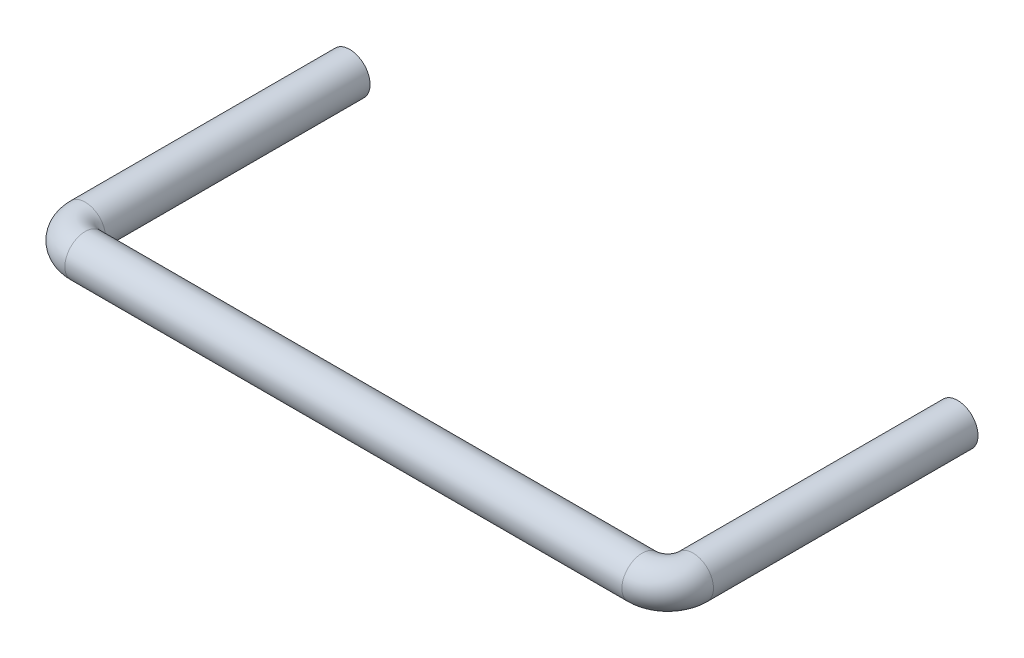
ISO-10303-21;
HEADER;
FILE_DESCRIPTION(('STEP AP214'),'2;1');
FILE_NAME('part.step','',(''),(''),'','','');
FILE_SCHEMA(('AUTOMOTIVE_DESIGN { 1 0 10303 214 1 1 1 1 }'));
ENDSEC;
DATA;
#1=APPLICATION_CONTEXT('core data for automotive mechanical design processes');
#2=APPLICATION_PROTOCOL_DEFINITION('international standard','automotive_design',2000,#1);
#3=PRODUCT_CONTEXT('',#1,'mechanical');
#4=PRODUCT('Part','Part','',(#3));
#5=PRODUCT_RELATED_PRODUCT_CATEGORY('part','',(#4));
#6=PRODUCT_DEFINITION_FORMATION('','',#4);
#7=PRODUCT_DEFINITION_CONTEXT('part definition',#1,'design');
#8=PRODUCT_DEFINITION('design','',#6,#7);
#9=PRODUCT_DEFINITION_SHAPE('','',#8);
#10=(LENGTH_UNIT() NAMED_UNIT(*) SI_UNIT(.MILLI.,.METRE.));
#11=(NAMED_UNIT(*) PLANE_ANGLE_UNIT() SI_UNIT($,.RADIAN.));
#12=(NAMED_UNIT(*) SI_UNIT($,.STERADIAN.) SOLID_ANGLE_UNIT());
#13=UNCERTAINTY_MEASURE_WITH_UNIT(LENGTH_MEASURE(1.E-05),#10,'distance_accuracy_value','');
#14=(GEOMETRIC_REPRESENTATION_CONTEXT(3) GLOBAL_UNCERTAINTY_ASSIGNED_CONTEXT((#13)) GLOBAL_UNIT_ASSIGNED_CONTEXT((#10,
#11,#12)) REPRESENTATION_CONTEXT('',''));
#15=CARTESIAN_POINT('',(0.,0.,0.));
#16=DIRECTION('',(0.,0.,1.));
#17=DIRECTION('',(1.,0.,0.));
#18=AXIS2_PLACEMENT_3D('',#15,#16,#17);
#19=CARTESIAN_POINT('',(11.95,0.,0.));
#20=DIRECTION('',(0.,0.,-1.));
#21=DIRECTION('',(-1.,0.,0.));
#22=AXIS2_PLACEMENT_3D('',#19,#20,#21);
#23=PLANE('',#22);
#24=CARTESIAN_POINT('',(11.95,0.,0.));
#25=DIRECTION('',(0.,0.,-1.));
#26=DIRECTION('',(-1.,0.,0.));
#27=AXIS2_PLACEMENT_3D('',#24,#25,#26);
#28=CIRCLE('',#27,0.8);
#29=CARTESIAN_POINT('',(11.15,0.,0.));
#30=VERTEX_POINT('',#29);
#31=EDGE_CURVE('E56',#30,#30,#28,.T.);
#32=ORIENTED_EDGE('',*,*,#31,.T.);
#33=EDGE_LOOP('',(#32));
#34=FACE_BOUND('',#33,.T.);
#35=ADVANCED_FACE('F44',(#34),#23,.T.);
#36=CARTESIAN_POINT('',(-11.95,0.,0.));
#37=DIRECTION('',(0.,0.,1.));
#38=DIRECTION('',(1.,0.,0.));
#39=AXIS2_PLACEMENT_3D('',#36,#37,#38);
#40=PLANE('',#39);
#41=CARTESIAN_POINT('',(-11.95,0.,0.));
#42=DIRECTION('',(0.,0.,1.));
#43=DIRECTION('',(1.,0.,0.));
#44=AXIS2_PLACEMENT_3D('',#41,#42,#43);
#45=CIRCLE('',#44,0.8);
#46=CARTESIAN_POINT('',(-11.15,0.,0.));
#47=VERTEX_POINT('',#46);
#48=EDGE_CURVE('E12',#47,#47,#45,.T.);
#49=ORIENTED_EDGE('',*,*,#48,.F.);
#50=EDGE_LOOP('',(#49));
#51=FACE_BOUND('',#50,.T.);
#52=ADVANCED_FACE('F62',(#51),#40,.F.);
#53=CARTESIAN_POINT('',(11.95,0.,0.));
#54=DIRECTION('',(0.,0.,1.));
#55=DIRECTION('',(1.,0.,0.));
#56=AXIS2_PLACEMENT_3D('',#53,#54,#55);
#57=CYLINDRICAL_SURFACE('',#56,0.8);
#58=CARTESIAN_POINT('',(11.95,0.,10.4));
#59=DIRECTION('',(0.,0.,-1.));
#60=DIRECTION('',(-1.,0.,0.));
#61=AXIS2_PLACEMENT_3D('',#58,#59,#60);
#62=CIRCLE('',#61,0.8);
#63=CARTESIAN_POINT('',(12.75,0.,10.4));
#64=VERTEX_POINT('',#63);
#65=EDGE_CURVE('E96',#64,#64,#62,.T.);
#66=ORIENTED_EDGE('',*,*,#65,.T.);
#67=EDGE_LOOP('',(#66));
#68=FACE_BOUND('',#67,.T.);
#69=ORIENTED_EDGE('',*,*,#31,.F.);
#70=EDGE_LOOP('',(#69));
#71=FACE_BOUND('',#70,.T.);
#72=ADVANCED_FACE('F64',(#68,#71),#57,.T.);
#73=CARTESIAN_POINT('',(10.95,0.,10.4));
#74=DIRECTION('',(0.,-1.,0.));
#75=DIRECTION('',(0.,0.,-1.));
#76=AXIS2_PLACEMENT_3D('',#73,#74,#75);
#77=TOROIDAL_SURFACE('',#76,1.,0.8);
#78=CARTESIAN_POINT('',(10.95,0.,11.4));
#79=DIRECTION('',(1.,0.,0.));
#80=DIRECTION('',(0.,0.,-1.));
#81=AXIS2_PLACEMENT_3D('',#78,#79,#80);
#82=CIRCLE('',#81,0.8);
#83=CARTESIAN_POINT('',(10.95,0.,12.2));
#84=VERTEX_POINT('',#83);
#85=EDGE_CURVE('E93',#84,#84,#82,.T.);
#86=CARTESIAN_POINT('',(10.95,0.,10.4));
#87=DIRECTION('',(0.,-1.,0.));
#88=DIRECTION('',(0.,0.,-1.));
#89=AXIS2_PLACEMENT_3D('',#86,#87,#88);
#90=CIRCLE('',#89,1.8);
#91=EDGE_CURVE('',#64,#84,#90,.T.);
#92=ORIENTED_EDGE('',*,*,#65,.F.);
#93=ORIENTED_EDGE('',*,*,#85,.T.);
#94=ORIENTED_EDGE('',*,*,#91,.T.);
#95=ORIENTED_EDGE('',*,*,#91,.F.);
#96=EDGE_LOOP('',(#92,#94,#93,#95));
#97=FACE_BOUND('',#96,.T.);
#98=ADVANCED_FACE('F69',(#97),#77,.T.);
#99=CARTESIAN_POINT('',(10.95,0.,11.4));
#100=DIRECTION('',(-1.,0.,0.));
#101=DIRECTION('',(0.,0.,1.));
#102=AXIS2_PLACEMENT_3D('',#99,#100,#101);
#103=CYLINDRICAL_SURFACE('',#102,0.8);
#104=CARTESIAN_POINT('',(-10.95,0.,11.4));
#105=DIRECTION('',(1.,0.,0.));
#106=DIRECTION('',(0.,0.,-1.));
#107=AXIS2_PLACEMENT_3D('',#104,#105,#106);
#108=CIRCLE('',#107,0.8);
#109=CARTESIAN_POINT('',(-10.95,0.,12.2));
#110=VERTEX_POINT('',#109);
#111=EDGE_CURVE('E98',#110,#110,#108,.T.);
#112=ORIENTED_EDGE('',*,*,#111,.T.);
#113=EDGE_LOOP('',(#112));
#114=FACE_BOUND('',#113,.T.);
#115=ORIENTED_EDGE('',*,*,#85,.F.);
#116=EDGE_LOOP('',(#115));
#117=FACE_BOUND('',#116,.T.);
#118=ADVANCED_FACE('F79',(#114,#117),#103,.T.);
#119=CARTESIAN_POINT('',(-10.95,0.,10.4));
#120=DIRECTION('',(0.,-1.,0.));
#121=DIRECTION('',(0.,0.,-1.));
#122=AXIS2_PLACEMENT_3D('',#119,#120,#121);
#123=TOROIDAL_SURFACE('',#122,0.999999999999999,0.8);
#124=CARTESIAN_POINT('',(-11.95,0.,10.4000000000001));
#125=DIRECTION('',(0.,0.,1.));
#126=DIRECTION('',(1.,0.,0.));
#127=AXIS2_PLACEMENT_3D('',#124,#125,#126);
#128=CIRCLE('',#127,0.8);
#129=CARTESIAN_POINT('',(-12.75,0.,10.4000000000002));
#130=VERTEX_POINT('',#129);
#131=EDGE_CURVE('E51',#130,#130,#128,.T.);
#132=CARTESIAN_POINT('',(-10.95,0.,10.4));
#133=DIRECTION('',(0.,-1.,0.));
#134=DIRECTION('',(0.,0.,-1.));
#135=AXIS2_PLACEMENT_3D('',#132,#133,#134);
#136=CIRCLE('',#135,1.8);
#137=EDGE_CURVE('',#110,#130,#136,.T.);
#138=ORIENTED_EDGE('',*,*,#111,.F.);
#139=ORIENTED_EDGE('',*,*,#131,.T.);
#140=ORIENTED_EDGE('',*,*,#137,.T.);
#141=ORIENTED_EDGE('',*,*,#137,.F.);
#142=EDGE_LOOP('',(#138,#140,#139,#141));
#143=FACE_BOUND('',#142,.T.);
#144=ADVANCED_FACE('F75',(#143),#123,.T.);
#145=CARTESIAN_POINT('',(-11.95,0.,10.4));
#146=DIRECTION('',(0.,0.,-1.));
#147=DIRECTION('',(-1.,0.,0.));
#148=AXIS2_PLACEMENT_3D('',#145,#146,#147);
#149=CYLINDRICAL_SURFACE('',#148,0.8);
#150=ORIENTED_EDGE('',*,*,#48,.T.);
#151=EDGE_LOOP('',(#150));
#152=FACE_BOUND('',#151,.T.);
#153=ORIENTED_EDGE('',*,*,#131,.F.);
#154=EDGE_LOOP('',(#153));
#155=FACE_BOUND('',#154,.T.);
#156=ADVANCED_FACE('F59',(#152,#155),#149,.T.);
#157=CLOSED_SHELL('',(#35,#52,#72,#98,#118,#144,#156));
#158=MANIFOLD_SOLID_BREP('B2',#157);
#159=ADVANCED_BREP_SHAPE_REPRESENTATION('',(#18,#158),#14);
#160=SHAPE_DEFINITION_REPRESENTATION(#9,#159);
ENDSEC;
END-ISO-10303-21;
